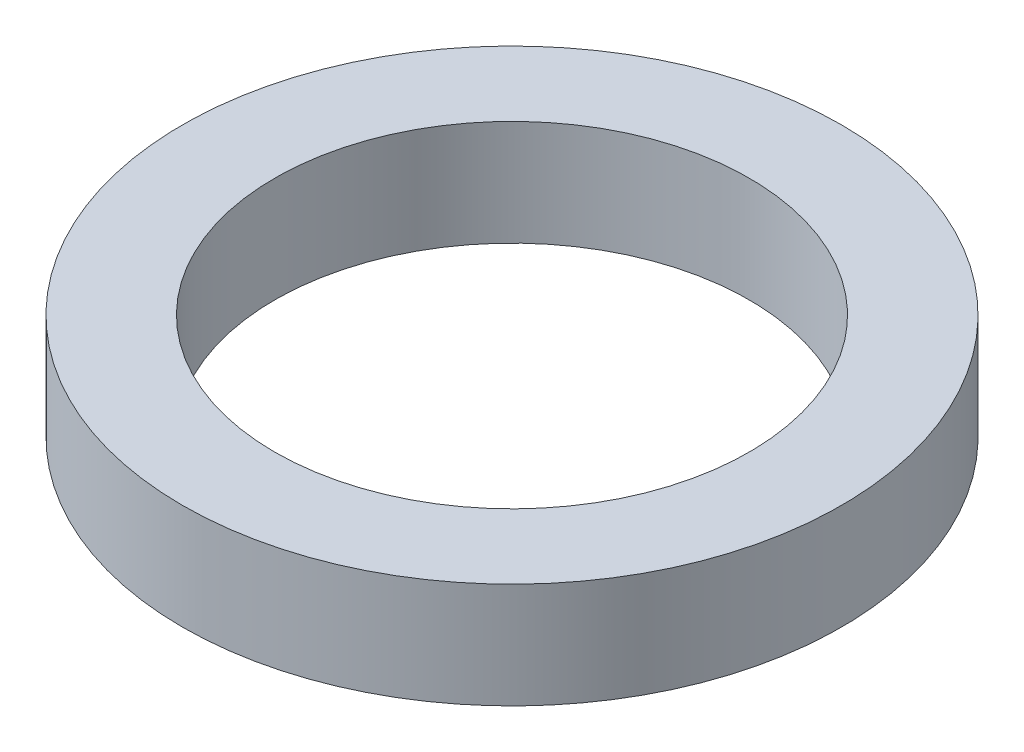
ISO-10303-21;
HEADER;
FILE_DESCRIPTION(('STEP AP214'),'2;1');
FILE_NAME('part.step','',(''),(''),'','','');
FILE_SCHEMA(('AUTOMOTIVE_DESIGN { 1 0 10303 214 1 1 1 1 }'));
ENDSEC;
DATA;
#1=APPLICATION_CONTEXT('core data for automotive mechanical design processes');
#2=APPLICATION_PROTOCOL_DEFINITION('international standard','automotive_design',2000,#1);
#3=PRODUCT_CONTEXT('',#1,'mechanical');
#4=PRODUCT('Part','Part','',(#3));
#5=PRODUCT_RELATED_PRODUCT_CATEGORY('part','',(#4));
#6=PRODUCT_DEFINITION_FORMATION('','',#4);
#7=PRODUCT_DEFINITION_CONTEXT('part definition',#1,'design');
#8=PRODUCT_DEFINITION('design','',#6,#7);
#9=PRODUCT_DEFINITION_SHAPE('','',#8);
#10=(LENGTH_UNIT() NAMED_UNIT(*) SI_UNIT(.MILLI.,.METRE.));
#11=(NAMED_UNIT(*) PLANE_ANGLE_UNIT() SI_UNIT($,.RADIAN.));
#12=(NAMED_UNIT(*) SI_UNIT($,.STERADIAN.) SOLID_ANGLE_UNIT());
#13=UNCERTAINTY_MEASURE_WITH_UNIT(LENGTH_MEASURE(1.E-05),#10,'distance_accuracy_value','');
#14=(GEOMETRIC_REPRESENTATION_CONTEXT(3) GLOBAL_UNCERTAINTY_ASSIGNED_CONTEXT((#13)) GLOBAL_UNIT_ASSIGNED_CONTEXT((#10,
#11,#12)) REPRESENTATION_CONTEXT('',''));
#15=CARTESIAN_POINT('',(0.,0.,0.));
#16=DIRECTION('',(0.,0.,1.));
#17=DIRECTION('',(1.,0.,0.));
#18=AXIS2_PLACEMENT_3D('',#15,#16,#17);
#19=CARTESIAN_POINT('',(0.,20.,0.));
#20=DIRECTION('',(0.,-1.,0.));
#21=DIRECTION('',(0.,0.,-1.));
#22=AXIS2_PLACEMENT_3D('',#19,#20,#21);
#23=CYLINDRICAL_SURFACE('',#22,62.5);
#24=CARTESIAN_POINT('',(0.,20.,0.));
#25=DIRECTION('',(0.,1.,0.));
#26=DIRECTION('',(0.,0.,1.));
#27=AXIS2_PLACEMENT_3D('',#24,#25,#26);
#28=CIRCLE('',#27,62.5);
#29=CARTESIAN_POINT('',(0.,20.,62.5));
#30=VERTEX_POINT('',#29);
#31=EDGE_CURVE('E10',#30,#30,#28,.T.);
#32=ORIENTED_EDGE('',*,*,#31,.F.);
#33=EDGE_LOOP('',(#32));
#34=FACE_BOUND('',#33,.T.);
#35=CARTESIAN_POINT('',(0.,0.,0.));
#36=DIRECTION('',(0.,1.,0.));
#37=DIRECTION('',(0.,0.,1.));
#38=AXIS2_PLACEMENT_3D('',#35,#36,#37);
#39=CIRCLE('',#38,62.5);
#40=CARTESIAN_POINT('',(0.,0.,62.5));
#41=VERTEX_POINT('',#40);
#42=EDGE_CURVE('E37',#41,#41,#39,.T.);
#43=ORIENTED_EDGE('',*,*,#42,.T.);
#44=EDGE_LOOP('',(#43));
#45=FACE_BOUND('',#44,.T.);
#46=ADVANCED_FACE('F40',(#34,#45),#23,.T.);
#47=CARTESIAN_POINT('',(0.,20.,0.));
#48=DIRECTION('',(0.,1.,0.));
#49=DIRECTION('',(0.,0.,1.));
#50=AXIS2_PLACEMENT_3D('',#47,#48,#49);
#51=PLANE('',#50);
#52=CARTESIAN_POINT('',(0.,20.,0.));
#53=DIRECTION('',(0.,1.,0.));
#54=DIRECTION('',(0.,0.,1.));
#55=AXIS2_PLACEMENT_3D('',#52,#53,#54);
#56=CIRCLE('',#55,45.);
#57=CARTESIAN_POINT('',(0.,20.,45.));
#58=VERTEX_POINT('',#57);
#59=EDGE_CURVE('E50',#58,#58,#56,.T.);
#60=ORIENTED_EDGE('',*,*,#59,.F.);
#61=EDGE_LOOP('',(#60));
#62=FACE_BOUND('',#61,.T.);
#63=ORIENTED_EDGE('',*,*,#31,.T.);
#64=EDGE_LOOP('',(#63));
#65=FACE_BOUND('',#64,.T.);
#66=ADVANCED_FACE('F59',(#62,#65),#51,.T.);
#67=CARTESIAN_POINT('',(0.,0.,0.));
#68=DIRECTION('',(0.,1.,0.));
#69=DIRECTION('',(0.,0.,1.));
#70=AXIS2_PLACEMENT_3D('',#67,#68,#69);
#71=PLANE('',#70);
#72=CARTESIAN_POINT('',(0.,0.,0.));
#73=DIRECTION('',(0.,1.,0.));
#74=DIRECTION('',(0.,0.,1.));
#75=AXIS2_PLACEMENT_3D('',#72,#73,#74);
#76=CIRCLE('',#75,45.);
#77=CARTESIAN_POINT('',(0.,0.,45.));
#78=VERTEX_POINT('',#77);
#79=EDGE_CURVE('E47',#78,#78,#76,.T.);
#80=ORIENTED_EDGE('',*,*,#79,.T.);
#81=EDGE_LOOP('',(#80));
#82=FACE_BOUND('',#81,.T.);
#83=ORIENTED_EDGE('',*,*,#42,.F.);
#84=EDGE_LOOP('',(#83));
#85=FACE_BOUND('',#84,.T.);
#86=ADVANCED_FACE('F58',(#82,#85),#71,.F.);
#87=CARTESIAN_POINT('',(0.,20.,0.));
#88=DIRECTION('',(0.,-1.,0.));
#89=DIRECTION('',(0.,0.,-1.));
#90=AXIS2_PLACEMENT_3D('',#87,#88,#89);
#91=CYLINDRICAL_SURFACE('',#90,45.);
#92=ORIENTED_EDGE('',*,*,#59,.T.);
#93=EDGE_LOOP('',(#92));
#94=FACE_BOUND('',#93,.T.);
#95=ORIENTED_EDGE('',*,*,#79,.F.);
#96=EDGE_LOOP('',(#95));
#97=FACE_BOUND('',#96,.T.);
#98=ADVANCED_FACE('F54',(#94,#97),#91,.F.);
#99=CLOSED_SHELL('',(#46,#66,#86,#98));
#100=MANIFOLD_SOLID_BREP('B2',#99);
#101=ADVANCED_BREP_SHAPE_REPRESENTATION('',(#18,#100),#14);
#102=SHAPE_DEFINITION_REPRESENTATION(#9,#101);
ENDSEC;
END-ISO-10303-21;
